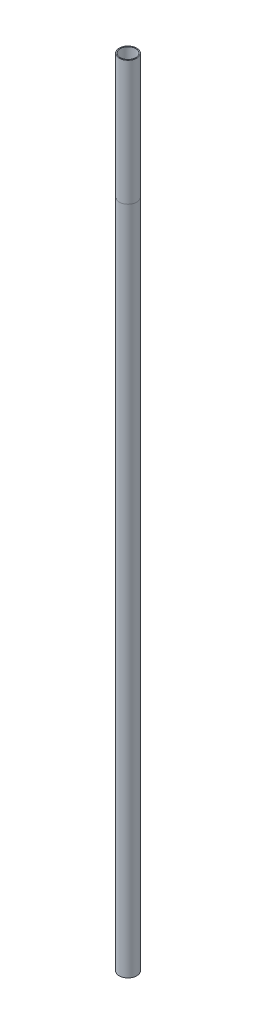
ISO-10303-21;
HEADER;
FILE_DESCRIPTION(('STEP AP214'),'2;1');
FILE_NAME('part.step','',(''),(''),'','','');
FILE_SCHEMA(('AUTOMOTIVE_DESIGN { 1 0 10303 214 1 1 1 1 }'));
ENDSEC;
DATA;
#1=APPLICATION_CONTEXT('core data for automotive mechanical design processes');
#2=APPLICATION_PROTOCOL_DEFINITION('international standard','automotive_design',2000,#1);
#3=PRODUCT_CONTEXT('',#1,'mechanical');
#4=PRODUCT('Part','Part','',(#3));
#5=PRODUCT_RELATED_PRODUCT_CATEGORY('part','',(#4));
#6=PRODUCT_DEFINITION_FORMATION('','',#4);
#7=PRODUCT_DEFINITION_CONTEXT('part definition',#1,'design');
#8=PRODUCT_DEFINITION('design','',#6,#7);
#9=PRODUCT_DEFINITION_SHAPE('','',#8);
#10=(LENGTH_UNIT() NAMED_UNIT(*) SI_UNIT(.MILLI.,.METRE.));
#11=(NAMED_UNIT(*) PLANE_ANGLE_UNIT() SI_UNIT($,.RADIAN.));
#12=(NAMED_UNIT(*) SI_UNIT($,.STERADIAN.) SOLID_ANGLE_UNIT());
#13=UNCERTAINTY_MEASURE_WITH_UNIT(LENGTH_MEASURE(1.E-05),#10,'distance_accuracy_value','');
#14=(GEOMETRIC_REPRESENTATION_CONTEXT(3) GLOBAL_UNCERTAINTY_ASSIGNED_CONTEXT((#13)) GLOBAL_UNIT_ASSIGNED_CONTEXT((#10,
#11,#12)) REPRESENTATION_CONTEXT('',''));
#15=CARTESIAN_POINT('',(0.,0.,0.));
#16=DIRECTION('',(0.,0.,1.));
#17=DIRECTION('',(1.,0.,0.));
#18=AXIS2_PLACEMENT_3D('',#15,#16,#17);
#19=CARTESIAN_POINT('',(0.,1295.4,0.));
#20=DIRECTION('',(0.,-1.,0.));
#21=DIRECTION('',(0.,0.,-1.));
#22=AXIS2_PLACEMENT_3D('',#19,#20,#21);
#23=CYLINDRICAL_SURFACE('',#22,14.2875);
#24=CARTESIAN_POINT('',(0.,1295.4,0.));
#25=DIRECTION('',(0.,1.,0.));
#26=DIRECTION('',(0.,0.,1.));
#27=AXIS2_PLACEMENT_3D('',#24,#25,#26);
#28=CIRCLE('',#27,14.2875);
#29=CARTESIAN_POINT('',(0.,1295.4,14.2875));
#30=VERTEX_POINT('',#29);
#31=EDGE_CURVE('E45',#30,#30,#28,.T.);
#32=ORIENTED_EDGE('',*,*,#31,.F.);
#33=EDGE_LOOP('',(#32));
#34=FACE_BOUND('',#33,.T.);
#35=CARTESIAN_POINT('',(0.,1092.2,0.));
#36=DIRECTION('',(0.,1.,0.));
#37=DIRECTION('',(0.,0.,1.));
#38=AXIS2_PLACEMENT_3D('',#35,#36,#37);
#39=CIRCLE('',#38,14.2875);
#40=CARTESIAN_POINT('',(0.,1092.2,14.2875));
#41=VERTEX_POINT('',#40);
#42=EDGE_CURVE('E12',#41,#41,#39,.T.);
#43=ORIENTED_EDGE('',*,*,#42,.T.);
#44=EDGE_LOOP('',(#43));
#45=FACE_BOUND('',#44,.T.);
#46=ADVANCED_FACE('F36',(#34,#45),#23,.T.);
#47=CARTESIAN_POINT('',(0.,1295.4,0.));
#48=DIRECTION('',(0.,-1.,0.));
#49=DIRECTION('',(0.,0.,-1.));
#50=AXIS2_PLACEMENT_3D('',#47,#48,#49);
#51=CYLINDRICAL_SURFACE('',#50,12.7);
#52=CARTESIAN_POINT('',(0.,1295.4,0.));
#53=DIRECTION('',(0.,1.,0.));
#54=DIRECTION('',(0.,0.,1.));
#55=AXIS2_PLACEMENT_3D('',#52,#53,#54);
#56=CIRCLE('',#55,12.7);
#57=CARTESIAN_POINT('',(0.,1295.4,12.7));
#58=VERTEX_POINT('',#57);
#59=EDGE_CURVE('E157',#58,#58,#56,.T.);
#60=ORIENTED_EDGE('',*,*,#59,.T.);
#61=EDGE_LOOP('',(#60));
#62=FACE_BOUND('',#61,.T.);
#63=CARTESIAN_POINT('',(0.,38.1,0.));
#64=DIRECTION('',(0.,-1.,0.));
#65=DIRECTION('',(0.,0.,-1.));
#66=AXIS2_PLACEMENT_3D('',#63,#64,#65);
#67=CIRCLE('',#66,12.7);
#68=CARTESIAN_POINT('',(0.,38.1,-12.7));
#69=VERTEX_POINT('',#68);
#70=EDGE_CURVE('E133',#69,#69,#67,.F.);
#71=ORIENTED_EDGE('',*,*,#70,.F.);
#72=EDGE_LOOP('',(#71));
#73=FACE_BOUND('',#72,.T.);
#74=ADVANCED_FACE('F214',(#62,#73),#51,.F.);
#75=CARTESIAN_POINT('',(0.,1295.4,0.));
#76=DIRECTION('',(0.,1.,0.));
#77=DIRECTION('',(0.,0.,1.));
#78=AXIS2_PLACEMENT_3D('',#75,#76,#77);
#79=PLANE('',#78);
#80=ORIENTED_EDGE('',*,*,#31,.T.);
#81=EDGE_LOOP('',(#80));
#82=FACE_BOUND('',#81,.T.);
#83=ORIENTED_EDGE('',*,*,#59,.F.);
#84=EDGE_LOOP('',(#83));
#85=FACE_BOUND('',#84,.T.);
#86=ADVANCED_FACE('F179',(#82,#85),#79,.T.);
#87=CARTESIAN_POINT('',(0.,0.,0.));
#88=DIRECTION('',(0.,1.,0.));
#89=DIRECTION('',(0.,0.,1.));
#90=AXIS2_PLACEMENT_3D('',#87,#88,#89);
#91=PLANE('',#90);
#92=CARTESIAN_POINT('',(0.,0.,0.));
#93=DIRECTION('',(0.,1.,0.));
#94=DIRECTION('',(0.,0.,1.));
#95=AXIS2_PLACEMENT_3D('',#92,#93,#94);
#96=CIRCLE('',#95,14.2875);
#97=CARTESIAN_POINT('',(0.,0.,14.2875));
#98=VERTEX_POINT('',#97);
#99=EDGE_CURVE('E171',#98,#98,#96,.T.);
#100=ORIENTED_EDGE('',*,*,#99,.F.);
#101=EDGE_LOOP('',(#100));
#102=FACE_BOUND('',#101,.T.);
#103=CARTESIAN_POINT('',(-6.985,0.,6.985));
#104=DIRECTION('',(0.,-1.,0.));
#105=DIRECTION('',(0.,0.,-1.));
#106=AXIS2_PLACEMENT_3D('',#103,#104,#105);
#107=CIRCLE('',#106,2.54);
#108=CARTESIAN_POINT('',(-6.985,0.,9.525));
#109=VERTEX_POINT('',#108);
#110=CARTESIAN_POINT('',(-9.525,0.,6.985));
#111=VERTEX_POINT('',#110);
#112=EDGE_CURVE('E137',#109,#111,#107,.T.);
#113=ORIENTED_EDGE('',*,*,#112,.F.);
#114=DIRECTION('',(-1.,0.,0.));
#115=VECTOR('',#114,1.);
#116=CARTESIAN_POINT('',(0.,0.,9.525));
#117=LINE('',#116,#115);
#118=CARTESIAN_POINT('',(6.985,0.,9.525));
#119=VERTEX_POINT('',#118);
#120=EDGE_CURVE('E140',#119,#109,#117,.T.);
#121=ORIENTED_EDGE('',*,*,#120,.F.);
#122=CARTESIAN_POINT('',(6.985,0.,6.985));
#123=DIRECTION('',(0.,-1.,0.));
#124=DIRECTION('',(0.,0.,-1.));
#125=AXIS2_PLACEMENT_3D('',#122,#123,#124);
#126=CIRCLE('',#125,2.54);
#127=CARTESIAN_POINT('',(9.525,0.,6.985));
#128=VERTEX_POINT('',#127);
#129=EDGE_CURVE('E142',#128,#119,#126,.T.);
#130=ORIENTED_EDGE('',*,*,#129,.F.);
#131=DIRECTION('',(0.,0.,-1.));
#132=VECTOR('',#131,1.);
#133=CARTESIAN_POINT('',(9.525,0.,0.));
#134=LINE('',#133,#132);
#135=CARTESIAN_POINT('',(9.525,0.,-6.985));
#136=VERTEX_POINT('',#135);
#137=EDGE_CURVE('E144',#128,#136,#134,.T.);
#138=ORIENTED_EDGE('',*,*,#137,.T.);
#139=CARTESIAN_POINT('',(6.985,0.,-6.985));
#140=DIRECTION('',(0.,-1.,0.));
#141=DIRECTION('',(0.,0.,-1.));
#142=AXIS2_PLACEMENT_3D('',#139,#140,#141);
#143=CIRCLE('',#142,2.54);
#144=CARTESIAN_POINT('',(6.985,0.,-9.525));
#145=VERTEX_POINT('',#144);
#146=EDGE_CURVE('E147',#145,#136,#143,.T.);
#147=ORIENTED_EDGE('',*,*,#146,.F.);
#148=DIRECTION('',(-1.,0.,0.));
#149=VECTOR('',#148,1.);
#150=CARTESIAN_POINT('',(0.,0.,-9.525));
#151=LINE('',#150,#149);
#152=CARTESIAN_POINT('',(-6.985,0.,-9.525));
#153=VERTEX_POINT('',#152);
#154=EDGE_CURVE('E150',#145,#153,#151,.T.);
#155=ORIENTED_EDGE('',*,*,#154,.T.);
#156=CARTESIAN_POINT('',(-6.985,0.,-6.985));
#157=DIRECTION('',(0.,-1.,0.));
#158=DIRECTION('',(0.,0.,-1.));
#159=AXIS2_PLACEMENT_3D('',#156,#157,#158);
#160=CIRCLE('',#159,2.54);
#161=CARTESIAN_POINT('',(-9.525,0.,-6.985));
#162=VERTEX_POINT('',#161);
#163=EDGE_CURVE('E117',#162,#153,#160,.T.);
#164=ORIENTED_EDGE('',*,*,#163,.F.);
#165=DIRECTION('',(0.,0.,-1.));
#166=VECTOR('',#165,1.);
#167=CARTESIAN_POINT('',(-9.525,0.,0.));
#168=LINE('',#167,#166);
#169=EDGE_CURVE('E79',#111,#162,#168,.T.);
#170=ORIENTED_EDGE('',*,*,#169,.F.);
#171=EDGE_LOOP('',(#113,#121,#130,#138,#147,#155,#164,#170));
#172=FACE_BOUND('',#171,.T.);
#173=ADVANCED_FACE('F177',(#102,#172),#91,.F.);
#174=ORIENTED_EDGE('',*,*,#42,.F.);
#175=EDGE_LOOP('',(#174));
#176=FACE_BOUND('',#175,.T.);
#177=ORIENTED_EDGE('',*,*,#99,.T.);
#178=EDGE_LOOP('',(#177));
#179=FACE_BOUND('',#178,.T.);
#180=ADVANCED_FACE('F38',(#176,#179),#23,.T.);
#181=CARTESIAN_POINT('',(-6.985,38.1,6.985));
#182=DIRECTION('',(0.,-1.,0.));
#183=DIRECTION('',(0.,0.,-1.));
#184=AXIS2_PLACEMENT_3D('',#181,#182,#183);
#185=CYLINDRICAL_SURFACE('',#184,2.54);
#186=ORIENTED_EDGE('',*,*,#112,.T.);
#187=DIRECTION('',(0.,-1.,0.));
#188=VECTOR('',#187,1.);
#189=CARTESIAN_POINT('',(-9.525,38.1,6.985));
#190=LINE('',#189,#188);
#191=CARTESIAN_POINT('',(-9.525,38.1,6.985));
#192=VERTEX_POINT('',#191);
#193=EDGE_CURVE('E155',#192,#111,#190,.T.);
#194=ORIENTED_EDGE('',*,*,#193,.F.);
#195=CARTESIAN_POINT('',(-6.985,38.1,6.985));
#196=DIRECTION('',(0.,-1.,0.));
#197=DIRECTION('',(0.,0.,-1.));
#198=AXIS2_PLACEMENT_3D('',#195,#196,#197);
#199=CIRCLE('',#198,2.54);
#200=CARTESIAN_POINT('',(-6.985,38.1,9.525));
#201=VERTEX_POINT('',#200);
#202=EDGE_CURVE('E154',#201,#192,#199,.T.);
#203=ORIENTED_EDGE('',*,*,#202,.F.);
#204=DIRECTION('',(0.,-1.,0.));
#205=VECTOR('',#204,1.);
#206=CARTESIAN_POINT('',(-6.985,38.1,9.525));
#207=LINE('',#206,#205);
#208=EDGE_CURVE('E136',#201,#109,#207,.T.);
#209=ORIENTED_EDGE('',*,*,#208,.T.);
#210=EDGE_LOOP('',(#186,#194,#203,#209));
#211=FACE_BOUND('',#210,.T.);
#212=ADVANCED_FACE('F184',(#211),#185,.F.);
#213=CARTESIAN_POINT('',(-9.525,38.1,0.));
#214=DIRECTION('',(-1.,0.,0.));
#215=DIRECTION('',(0.,0.,1.));
#216=AXIS2_PLACEMENT_3D('',#213,#214,#215);
#217=PLANE('',#216);
#218=ORIENTED_EDGE('',*,*,#169,.T.);
#219=DIRECTION('',(0.,-1.,0.));
#220=VECTOR('',#219,1.);
#221=CARTESIAN_POINT('',(-9.525,38.1,-6.985));
#222=LINE('',#221,#220);
#223=CARTESIAN_POINT('',(-9.525,38.1,-6.985));
#224=VERTEX_POINT('',#223);
#225=EDGE_CURVE('E121',#224,#162,#222,.T.);
#226=ORIENTED_EDGE('',*,*,#225,.F.);
#227=DIRECTION('',(0.,0.,-1.));
#228=VECTOR('',#227,1.);
#229=CARTESIAN_POINT('',(-9.525,38.1,0.));
#230=LINE('',#229,#228);
#231=EDGE_CURVE('E53',#192,#224,#230,.T.);
#232=ORIENTED_EDGE('',*,*,#231,.F.);
#233=ORIENTED_EDGE('',*,*,#193,.T.);
#234=EDGE_LOOP('',(#218,#226,#232,#233));
#235=FACE_BOUND('',#234,.T.);
#236=ADVANCED_FACE('F228',(#235),#217,.F.);
#237=CARTESIAN_POINT('',(-6.985,38.1,-6.985));
#238=DIRECTION('',(0.,-1.,0.));
#239=DIRECTION('',(0.,0.,-1.));
#240=AXIS2_PLACEMENT_3D('',#237,#238,#239);
#241=CYLINDRICAL_SURFACE('',#240,2.54);
#242=ORIENTED_EDGE('',*,*,#163,.T.);
#243=DIRECTION('',(0.,-1.,0.));
#244=VECTOR('',#243,1.);
#245=CARTESIAN_POINT('',(-6.985,38.1,-9.525));
#246=LINE('',#245,#244);
#247=CARTESIAN_POINT('',(-6.985,38.1,-9.525));
#248=VERTEX_POINT('',#247);
#249=EDGE_CURVE('E115',#248,#153,#246,.T.);
#250=ORIENTED_EDGE('',*,*,#249,.F.);
#251=CARTESIAN_POINT('',(-6.985,38.1,-6.985));
#252=DIRECTION('',(0.,-1.,0.));
#253=DIRECTION('',(0.,0.,-1.));
#254=AXIS2_PLACEMENT_3D('',#251,#252,#253);
#255=CIRCLE('',#254,2.54);
#256=EDGE_CURVE('E106',#224,#248,#255,.T.);
#257=ORIENTED_EDGE('',*,*,#256,.F.);
#258=ORIENTED_EDGE('',*,*,#225,.T.);
#259=EDGE_LOOP('',(#242,#250,#257,#258));
#260=FACE_BOUND('',#259,.T.);
#261=ADVANCED_FACE('F116',(#260),#241,.F.);
#262=CARTESIAN_POINT('',(0.,38.1,-9.525));
#263=DIRECTION('',(0.,0.,1.));
#264=DIRECTION('',(1.,0.,0.));
#265=AXIS2_PLACEMENT_3D('',#262,#263,#264);
#266=PLANE('',#265);
#267=ORIENTED_EDGE('',*,*,#154,.F.);
#268=DIRECTION('',(0.,-1.,0.));
#269=VECTOR('',#268,1.);
#270=CARTESIAN_POINT('',(6.985,38.1,-9.525));
#271=LINE('',#270,#269);
#272=CARTESIAN_POINT('',(6.985,38.1,-9.525));
#273=VERTEX_POINT('',#272);
#274=EDGE_CURVE('E122',#273,#145,#271,.T.);
#275=ORIENTED_EDGE('',*,*,#274,.F.);
#276=DIRECTION('',(-1.,0.,0.));
#277=VECTOR('',#276,1.);
#278=CARTESIAN_POINT('',(0.,38.1,-9.525));
#279=LINE('',#278,#277);
#280=EDGE_CURVE('E111',#273,#248,#279,.T.);
#281=ORIENTED_EDGE('',*,*,#280,.T.);
#282=ORIENTED_EDGE('',*,*,#249,.T.);
#283=EDGE_LOOP('',(#267,#275,#281,#282));
#284=FACE_BOUND('',#283,.T.);
#285=ADVANCED_FACE('F124',(#284),#266,.T.);
#286=CARTESIAN_POINT('',(6.985,38.1,-6.985));
#287=DIRECTION('',(0.,-1.,0.));
#288=DIRECTION('',(0.,0.,-1.));
#289=AXIS2_PLACEMENT_3D('',#286,#287,#288);
#290=CYLINDRICAL_SURFACE('',#289,2.54);
#291=ORIENTED_EDGE('',*,*,#146,.T.);
#292=DIRECTION('',(0.,-1.,0.));
#293=VECTOR('',#292,1.);
#294=CARTESIAN_POINT('',(9.525,38.1,-6.985));
#295=LINE('',#294,#293);
#296=CARTESIAN_POINT('',(9.525,38.1,-6.985));
#297=VERTEX_POINT('',#296);
#298=EDGE_CURVE('E160',#297,#136,#295,.T.);
#299=ORIENTED_EDGE('',*,*,#298,.F.);
#300=CARTESIAN_POINT('',(6.985,38.1,-6.985));
#301=DIRECTION('',(0.,-1.,0.));
#302=DIRECTION('',(0.,0.,-1.));
#303=AXIS2_PLACEMENT_3D('',#300,#301,#302);
#304=CIRCLE('',#303,2.54);
#305=EDGE_CURVE('E126',#273,#297,#304,.T.);
#306=ORIENTED_EDGE('',*,*,#305,.F.);
#307=ORIENTED_EDGE('',*,*,#274,.T.);
#308=EDGE_LOOP('',(#291,#299,#306,#307));
#309=FACE_BOUND('',#308,.T.);
#310=ADVANCED_FACE('F201',(#309),#290,.F.);
#311=CARTESIAN_POINT('',(9.525,38.1,0.));
#312=DIRECTION('',(-1.,0.,0.));
#313=DIRECTION('',(0.,0.,1.));
#314=AXIS2_PLACEMENT_3D('',#311,#312,#313);
#315=PLANE('',#314);
#316=ORIENTED_EDGE('',*,*,#137,.F.);
#317=DIRECTION('',(0.,-1.,0.));
#318=VECTOR('',#317,1.);
#319=CARTESIAN_POINT('',(9.525,38.1,6.985));
#320=LINE('',#319,#318);
#321=CARTESIAN_POINT('',(9.525,38.1,6.985));
#322=VERTEX_POINT('',#321);
#323=EDGE_CURVE('E162',#322,#128,#320,.T.);
#324=ORIENTED_EDGE('',*,*,#323,.F.);
#325=DIRECTION('',(0.,0.,-1.));
#326=VECTOR('',#325,1.);
#327=CARTESIAN_POINT('',(9.525,38.1,0.));
#328=LINE('',#327,#326);
#329=EDGE_CURVE('E128',#322,#297,#328,.T.);
#330=ORIENTED_EDGE('',*,*,#329,.T.);
#331=ORIENTED_EDGE('',*,*,#298,.T.);
#332=EDGE_LOOP('',(#316,#324,#330,#331));
#333=FACE_BOUND('',#332,.T.);
#334=ADVANCED_FACE('F197',(#333),#315,.T.);
#335=CARTESIAN_POINT('',(6.985,38.1,6.985));
#336=DIRECTION('',(0.,-1.,0.));
#337=DIRECTION('',(0.,0.,-1.));
#338=AXIS2_PLACEMENT_3D('',#335,#336,#337);
#339=CYLINDRICAL_SURFACE('',#338,2.54);
#340=ORIENTED_EDGE('',*,*,#129,.T.);
#341=DIRECTION('',(0.,-1.,0.));
#342=VECTOR('',#341,1.);
#343=CARTESIAN_POINT('',(6.985,38.1,9.525));
#344=LINE('',#343,#342);
#345=CARTESIAN_POINT('',(6.985,38.1,9.525));
#346=VERTEX_POINT('',#345);
#347=EDGE_CURVE('E164',#346,#119,#344,.T.);
#348=ORIENTED_EDGE('',*,*,#347,.F.);
#349=CARTESIAN_POINT('',(6.985,38.1,6.985));
#350=DIRECTION('',(0.,-1.,0.));
#351=DIRECTION('',(0.,0.,-1.));
#352=AXIS2_PLACEMENT_3D('',#349,#350,#351);
#353=CIRCLE('',#352,2.54);
#354=EDGE_CURVE('E192',#322,#346,#353,.T.);
#355=ORIENTED_EDGE('',*,*,#354,.F.);
#356=ORIENTED_EDGE('',*,*,#323,.T.);
#357=EDGE_LOOP('',(#340,#348,#355,#356));
#358=FACE_BOUND('',#357,.T.);
#359=ADVANCED_FACE('F191',(#358),#339,.F.);
#360=CARTESIAN_POINT('',(0.,38.1,9.525));
#361=DIRECTION('',(0.,0.,1.));
#362=DIRECTION('',(1.,0.,0.));
#363=AXIS2_PLACEMENT_3D('',#360,#361,#362);
#364=PLANE('',#363);
#365=ORIENTED_EDGE('',*,*,#120,.T.);
#366=ORIENTED_EDGE('',*,*,#208,.F.);
#367=DIRECTION('',(-1.,0.,0.));
#368=VECTOR('',#367,1.);
#369=CARTESIAN_POINT('',(0.,38.1,9.525));
#370=LINE('',#369,#368);
#371=EDGE_CURVE('E91',#346,#201,#370,.T.);
#372=ORIENTED_EDGE('',*,*,#371,.F.);
#373=ORIENTED_EDGE('',*,*,#347,.T.);
#374=EDGE_LOOP('',(#365,#366,#372,#373));
#375=FACE_BOUND('',#374,.T.);
#376=ADVANCED_FACE('F187',(#375),#364,.F.);
#377=CARTESIAN_POINT('',(0.,38.1,0.));
#378=DIRECTION('',(0.,-1.,0.));
#379=DIRECTION('',(0.,0.,-1.));
#380=AXIS2_PLACEMENT_3D('',#377,#378,#379);
#381=PLANE('',#380);
#382=ORIENTED_EDGE('',*,*,#202,.T.);
#383=ORIENTED_EDGE('',*,*,#231,.T.);
#384=ORIENTED_EDGE('',*,*,#256,.T.);
#385=ORIENTED_EDGE('',*,*,#280,.F.);
#386=ORIENTED_EDGE('',*,*,#305,.T.);
#387=ORIENTED_EDGE('',*,*,#329,.F.);
#388=ORIENTED_EDGE('',*,*,#354,.T.);
#389=ORIENTED_EDGE('',*,*,#371,.T.);
#390=EDGE_LOOP('',(#382,#383,#384,#385,#386,#387,#388,#389));
#391=FACE_BOUND('',#390,.T.);
#392=ORIENTED_EDGE('',*,*,#70,.T.);
#393=EDGE_LOOP('',(#392));
#394=FACE_BOUND('',#393,.T.);
#395=ADVANCED_FACE('F108',(#391,#394),#381,.F.);
#396=CLOSED_SHELL('',(#46,#74,#86,#173,#180,#212,#236,#261,#285,#310,#334,#359,#376,#395));
#397=MANIFOLD_SOLID_BREP('B2',#396);
#398=ADVANCED_BREP_SHAPE_REPRESENTATION('',(#18,#397),#14);
#399=SHAPE_DEFINITION_REPRESENTATION(#9,#398);
ENDSEC;
END-ISO-10303-21;
